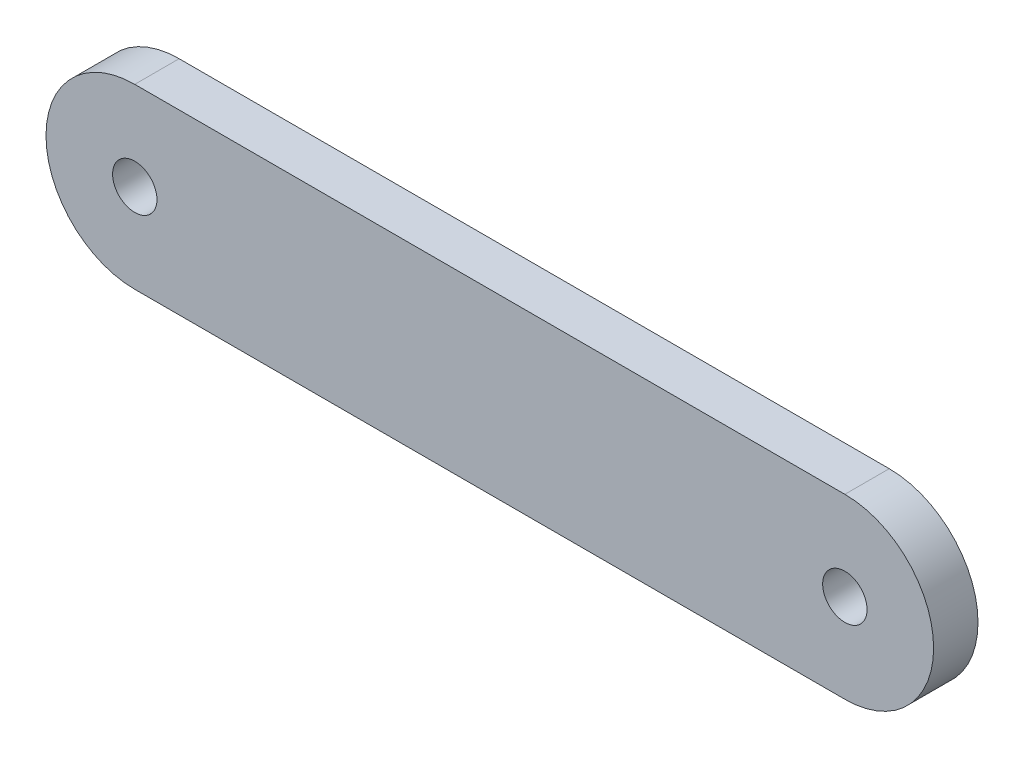
ISO-10303-21;
HEADER;
FILE_DESCRIPTION(('STEP AP214'),'2;1');
FILE_NAME('part.step','',(''),(''),'','','');
FILE_SCHEMA(('AUTOMOTIVE_DESIGN { 1 0 10303 214 1 1 1 1 }'));
ENDSEC;
DATA;
#1=APPLICATION_CONTEXT('core data for automotive mechanical design processes');
#2=APPLICATION_PROTOCOL_DEFINITION('international standard','automotive_design',2000,#1);
#3=PRODUCT_CONTEXT('',#1,'mechanical');
#4=PRODUCT('Part','Part','',(#3));
#5=PRODUCT_RELATED_PRODUCT_CATEGORY('part','',(#4));
#6=PRODUCT_DEFINITION_FORMATION('','',#4);
#7=PRODUCT_DEFINITION_CONTEXT('part definition',#1,'design');
#8=PRODUCT_DEFINITION('design','',#6,#7);
#9=PRODUCT_DEFINITION_SHAPE('','',#8);
#10=(LENGTH_UNIT() NAMED_UNIT(*) SI_UNIT(.MILLI.,.METRE.));
#11=(NAMED_UNIT(*) PLANE_ANGLE_UNIT() SI_UNIT($,.RADIAN.));
#12=(NAMED_UNIT(*) SI_UNIT($,.STERADIAN.) SOLID_ANGLE_UNIT());
#13=UNCERTAINTY_MEASURE_WITH_UNIT(LENGTH_MEASURE(1.E-05),#10,'distance_accuracy_value','');
#14=(GEOMETRIC_REPRESENTATION_CONTEXT(3) GLOBAL_UNCERTAINTY_ASSIGNED_CONTEXT((#13)) GLOBAL_UNIT_ASSIGNED_CONTEXT((#10,
#11,#12)) REPRESENTATION_CONTEXT('',''));
#15=CARTESIAN_POINT('',(0.,0.,0.));
#16=DIRECTION('',(0.,0.,1.));
#17=DIRECTION('',(1.,0.,0.));
#18=AXIS2_PLACEMENT_3D('',#15,#16,#17);
#19=CARTESIAN_POINT('',(-48.768,20.066,3.175));
#20=DIRECTION('',(0.,0.,1.));
#21=DIRECTION('',(1.,0.,0.));
#22=AXIS2_PLACEMENT_3D('',#19,#20,#21);
#23=PLANE('',#22);
#24=CARTESIAN_POINT('',(-48.768,20.066,3.175));
#25=DIRECTION('',(0.,0.,1.));
#26=DIRECTION('',(1.,0.,0.));
#27=AXIS2_PLACEMENT_3D('',#24,#25,#26);
#28=CIRCLE('',#27,1.5875);
#29=CARTESIAN_POINT('',(-47.1805,20.066,3.175));
#30=VERTEX_POINT('',#29);
#31=EDGE_CURVE('E100',#30,#30,#28,.T.);
#32=ORIENTED_EDGE('',*,*,#31,.F.);
#33=EDGE_LOOP('',(#32));
#34=FACE_BOUND('',#33,.T.);
#35=CARTESIAN_POINT('',(-48.768,20.066,3.175));
#36=DIRECTION('',(0.,0.,1.));
#37=DIRECTION('',(1.,0.,0.));
#38=AXIS2_PLACEMENT_3D('',#35,#36,#37);
#39=CIRCLE('',#38,6.35);
#40=CARTESIAN_POINT('',(-48.768,26.416,3.175));
#41=VERTEX_POINT('',#40);
#42=CARTESIAN_POINT('',(-48.768,13.716,3.175));
#43=VERTEX_POINT('',#42);
#44=EDGE_CURVE('E85',#41,#43,#39,.T.);
#45=ORIENTED_EDGE('',*,*,#44,.T.);
#46=DIRECTION('',(1.,0.,0.));
#47=VECTOR('',#46,1.);
#48=CARTESIAN_POINT('',(-48.768,13.716,3.175));
#49=LINE('',#48,#47);
#50=CARTESIAN_POINT('',(2.032,13.716,3.175));
#51=VERTEX_POINT('',#50);
#52=EDGE_CURVE('E80',#43,#51,#49,.T.);
#53=ORIENTED_EDGE('',*,*,#52,.T.);
#54=CARTESIAN_POINT('',(2.03200000000001,20.066,3.175));
#55=DIRECTION('',(0.,0.,1.));
#56=DIRECTION('',(1.,0.,0.));
#57=AXIS2_PLACEMENT_3D('',#54,#55,#56);
#58=CIRCLE('',#57,6.35);
#59=CARTESIAN_POINT('',(2.03200000000001,26.416,3.175));
#60=VERTEX_POINT('',#59);
#61=EDGE_CURVE('E83',#51,#60,#58,.T.);
#62=ORIENTED_EDGE('',*,*,#61,.T.);
#63=DIRECTION('',(-1.,0.,0.));
#64=VECTOR('',#63,1.);
#65=CARTESIAN_POINT('',(-48.768,26.416,3.175));
#66=LINE('',#65,#64);
#67=EDGE_CURVE('E50',#60,#41,#66,.T.);
#68=ORIENTED_EDGE('',*,*,#67,.T.);
#69=EDGE_LOOP('',(#45,#53,#62,#68));
#70=FACE_BOUND('',#69,.T.);
#71=CARTESIAN_POINT('',(2.03200000000001,20.066,3.175));
#72=DIRECTION('',(0.,0.,1.));
#73=DIRECTION('',(1.,0.,0.));
#74=AXIS2_PLACEMENT_3D('',#71,#72,#73);
#75=CIRCLE('',#74,1.5875);
#76=CARTESIAN_POINT('',(3.61950000000001,20.066,3.175));
#77=VERTEX_POINT('',#76);
#78=EDGE_CURVE('E115',#77,#77,#75,.T.);
#79=ORIENTED_EDGE('',*,*,#78,.F.);
#80=EDGE_LOOP('',(#79));
#81=FACE_BOUND('',#80,.T.);
#82=ADVANCED_FACE('F33',(#34,#70,#81),#23,.T.);
#83=CARTESIAN_POINT('',(-48.768,20.066,0.));
#84=DIRECTION('',(0.,0.,1.));
#85=DIRECTION('',(1.,0.,0.));
#86=AXIS2_PLACEMENT_3D('',#83,#84,#85);
#87=PLANE('',#86);
#88=CARTESIAN_POINT('',(-48.768,20.066,0.));
#89=DIRECTION('',(0.,0.,1.));
#90=DIRECTION('',(1.,0.,0.));
#91=AXIS2_PLACEMENT_3D('',#88,#89,#90);
#92=CIRCLE('',#91,6.35);
#93=CARTESIAN_POINT('',(-48.768,26.416,0.));
#94=VERTEX_POINT('',#93);
#95=CARTESIAN_POINT('',(-48.768,13.716,0.));
#96=VERTEX_POINT('',#95);
#97=EDGE_CURVE('E97',#94,#96,#92,.T.);
#98=ORIENTED_EDGE('',*,*,#97,.F.);
#99=DIRECTION('',(-1.,0.,0.));
#100=VECTOR('',#99,1.);
#101=CARTESIAN_POINT('',(-48.768,26.416,0.));
#102=LINE('',#101,#100);
#103=CARTESIAN_POINT('',(2.03200000000001,26.416,0.));
#104=VERTEX_POINT('',#103);
#105=EDGE_CURVE('E73',#104,#94,#102,.T.);
#106=ORIENTED_EDGE('',*,*,#105,.F.);
#107=CARTESIAN_POINT('',(2.03200000000001,20.066,0.));
#108=DIRECTION('',(0.,0.,1.));
#109=DIRECTION('',(1.,0.,0.));
#110=AXIS2_PLACEMENT_3D('',#107,#108,#109);
#111=CIRCLE('',#110,6.35);
#112=CARTESIAN_POINT('',(2.032,13.716,0.));
#113=VERTEX_POINT('',#112);
#114=EDGE_CURVE('E67',#113,#104,#111,.T.);
#115=ORIENTED_EDGE('',*,*,#114,.F.);
#116=DIRECTION('',(1.,0.,0.));
#117=VECTOR('',#116,1.);
#118=CARTESIAN_POINT('',(-48.768,13.716,0.));
#119=LINE('',#118,#117);
#120=EDGE_CURVE('E89',#96,#113,#119,.T.);
#121=ORIENTED_EDGE('',*,*,#120,.F.);
#122=EDGE_LOOP('',(#98,#106,#115,#121));
#123=FACE_BOUND('',#122,.T.);
#124=CARTESIAN_POINT('',(-48.768,20.066,0.));
#125=DIRECTION('',(0.,0.,1.));
#126=DIRECTION('',(1.,0.,0.));
#127=AXIS2_PLACEMENT_3D('',#124,#125,#126);
#128=CIRCLE('',#127,1.5875);
#129=CARTESIAN_POINT('',(-47.1805,20.066,0.));
#130=VERTEX_POINT('',#129);
#131=EDGE_CURVE('E112',#130,#130,#128,.T.);
#132=ORIENTED_EDGE('',*,*,#131,.T.);
#133=EDGE_LOOP('',(#132));
#134=FACE_BOUND('',#133,.T.);
#135=CARTESIAN_POINT('',(2.03200000000001,20.066,0.));
#136=DIRECTION('',(0.,0.,1.));
#137=DIRECTION('',(1.,0.,0.));
#138=AXIS2_PLACEMENT_3D('',#135,#136,#137);
#139=CIRCLE('',#138,1.5875);
#140=CARTESIAN_POINT('',(3.61950000000001,20.066,0.));
#141=VERTEX_POINT('',#140);
#142=EDGE_CURVE('E118',#141,#141,#139,.T.);
#143=ORIENTED_EDGE('',*,*,#142,.T.);
#144=EDGE_LOOP('',(#143));
#145=FACE_BOUND('',#144,.T.);
#146=ADVANCED_FACE('F108',(#123,#134,#145),#87,.F.);
#147=CARTESIAN_POINT('',(-48.768,20.066,3.175));
#148=DIRECTION('',(0.,0.,-1.));
#149=DIRECTION('',(-1.,0.,0.));
#150=AXIS2_PLACEMENT_3D('',#147,#148,#149);
#151=CYLINDRICAL_SURFACE('',#150,6.35);
#152=ORIENTED_EDGE('',*,*,#97,.T.);
#153=DIRECTION('',(0.,0.,-1.));
#154=VECTOR('',#153,1.);
#155=CARTESIAN_POINT('',(-48.768,13.716,3.175));
#156=LINE('',#155,#154);
#157=EDGE_CURVE('E11',#43,#96,#156,.T.);
#158=ORIENTED_EDGE('',*,*,#157,.F.);
#159=ORIENTED_EDGE('',*,*,#44,.F.);
#160=DIRECTION('',(0.,0.,-1.));
#161=VECTOR('',#160,1.);
#162=CARTESIAN_POINT('',(-48.768,26.416,3.175));
#163=LINE('',#162,#161);
#164=EDGE_CURVE('E93',#41,#94,#163,.T.);
#165=ORIENTED_EDGE('',*,*,#164,.T.);
#166=EDGE_LOOP('',(#152,#158,#159,#165));
#167=FACE_BOUND('',#166,.T.);
#168=ADVANCED_FACE('F35',(#167),#151,.T.);
#169=CARTESIAN_POINT('',(-48.768,13.716,3.175));
#170=DIRECTION('',(0.,1.,0.));
#171=DIRECTION('',(0.,0.,1.));
#172=AXIS2_PLACEMENT_3D('',#169,#170,#171);
#173=PLANE('',#172);
#174=ORIENTED_EDGE('',*,*,#120,.T.);
#175=DIRECTION('',(0.,0.,-1.));
#176=VECTOR('',#175,1.);
#177=CARTESIAN_POINT('',(2.032,13.716,3.175));
#178=LINE('',#177,#176);
#179=EDGE_CURVE('E42',#51,#113,#178,.T.);
#180=ORIENTED_EDGE('',*,*,#179,.F.);
#181=ORIENTED_EDGE('',*,*,#52,.F.);
#182=ORIENTED_EDGE('',*,*,#157,.T.);
#183=EDGE_LOOP('',(#174,#180,#181,#182));
#184=FACE_BOUND('',#183,.T.);
#185=ADVANCED_FACE('F88',(#184),#173,.F.);
#186=CARTESIAN_POINT('',(2.03200000000001,20.066,3.175));
#187=DIRECTION('',(0.,0.,-1.));
#188=DIRECTION('',(-1.,0.,0.));
#189=AXIS2_PLACEMENT_3D('',#186,#187,#188);
#190=CYLINDRICAL_SURFACE('',#189,6.35);
#191=ORIENTED_EDGE('',*,*,#114,.T.);
#192=DIRECTION('',(0.,0.,-1.));
#193=VECTOR('',#192,1.);
#194=CARTESIAN_POINT('',(2.03200000000001,26.416,3.175));
#195=LINE('',#194,#193);
#196=EDGE_CURVE('E90',#60,#104,#195,.T.);
#197=ORIENTED_EDGE('',*,*,#196,.F.);
#198=ORIENTED_EDGE('',*,*,#61,.F.);
#199=ORIENTED_EDGE('',*,*,#179,.T.);
#200=EDGE_LOOP('',(#191,#197,#198,#199));
#201=FACE_BOUND('',#200,.T.);
#202=ADVANCED_FACE('F91',(#201),#190,.T.);
#203=CARTESIAN_POINT('',(-48.768,26.416,3.175));
#204=DIRECTION('',(0.,-1.,0.));
#205=DIRECTION('',(0.,0.,-1.));
#206=AXIS2_PLACEMENT_3D('',#203,#204,#205);
#207=PLANE('',#206);
#208=ORIENTED_EDGE('',*,*,#105,.T.);
#209=ORIENTED_EDGE('',*,*,#164,.F.);
#210=ORIENTED_EDGE('',*,*,#67,.F.);
#211=ORIENTED_EDGE('',*,*,#196,.T.);
#212=EDGE_LOOP('',(#208,#209,#210,#211));
#213=FACE_BOUND('',#212,.T.);
#214=ADVANCED_FACE('F105',(#213),#207,.F.);
#215=CARTESIAN_POINT('',(-48.768,20.066,3.175));
#216=DIRECTION('',(0.,0.,-1.));
#217=DIRECTION('',(-1.,0.,0.));
#218=AXIS2_PLACEMENT_3D('',#215,#216,#217);
#219=CYLINDRICAL_SURFACE('',#218,1.5875);
#220=ORIENTED_EDGE('',*,*,#31,.T.);
#221=EDGE_LOOP('',(#220));
#222=FACE_BOUND('',#221,.T.);
#223=ORIENTED_EDGE('',*,*,#131,.F.);
#224=EDGE_LOOP('',(#223));
#225=FACE_BOUND('',#224,.T.);
#226=ADVANCED_FACE('F135',(#222,#225),#219,.F.);
#227=CARTESIAN_POINT('',(2.03200000000001,20.066,3.175));
#228=DIRECTION('',(0.,0.,-1.));
#229=DIRECTION('',(-1.,0.,0.));
#230=AXIS2_PLACEMENT_3D('',#227,#228,#229);
#231=CYLINDRICAL_SURFACE('',#230,1.5875);
#232=ORIENTED_EDGE('',*,*,#78,.T.);
#233=EDGE_LOOP('',(#232));
#234=FACE_BOUND('',#233,.T.);
#235=ORIENTED_EDGE('',*,*,#142,.F.);
#236=EDGE_LOOP('',(#235));
#237=FACE_BOUND('',#236,.T.);
#238=ADVANCED_FACE('F124',(#234,#237),#231,.F.);
#239=CLOSED_SHELL('',(#82,#146,#168,#185,#202,#214,#226,#238));
#240=MANIFOLD_SOLID_BREP('B2',#239);
#241=ADVANCED_BREP_SHAPE_REPRESENTATION('',(#18,#240),#14);
#242=SHAPE_DEFINITION_REPRESENTATION(#9,#241);
ENDSEC;
END-ISO-10303-21;
